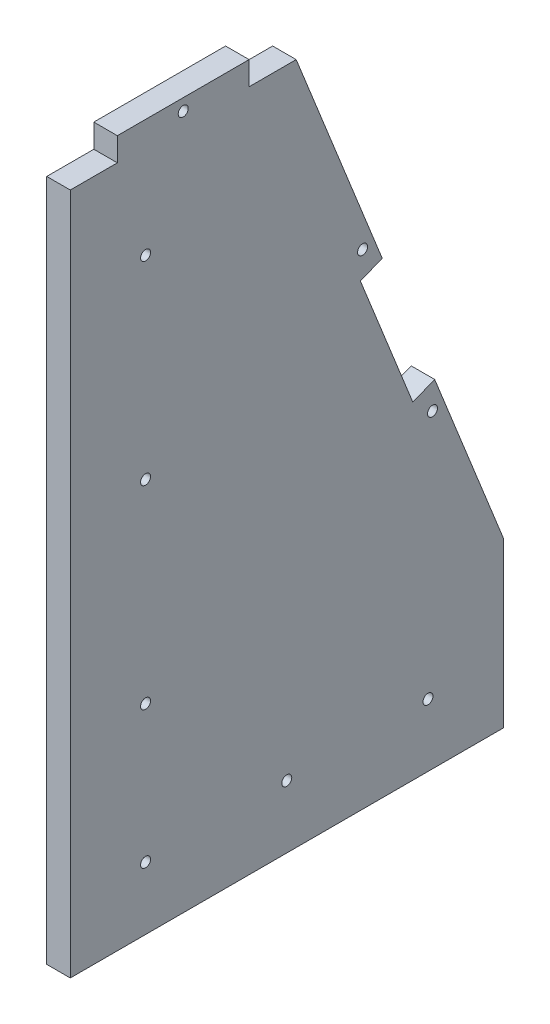
ISO-10303-21;
HEADER;
FILE_DESCRIPTION(('STEP AP214'),'2;1');
FILE_NAME('part.step','',(''),(''),'','','');
FILE_SCHEMA(('AUTOMOTIVE_DESIGN { 1 0 10303 214 1 1 1 1 }'));
ENDSEC;
DATA;
#1=APPLICATION_CONTEXT('core data for automotive mechanical design processes');
#2=APPLICATION_PROTOCOL_DEFINITION('international standard','automotive_design',2000,#1);
#3=PRODUCT_CONTEXT('',#1,'mechanical');
#4=PRODUCT('Part','Part','',(#3));
#5=PRODUCT_RELATED_PRODUCT_CATEGORY('part','',(#4));
#6=PRODUCT_DEFINITION_FORMATION('','',#4);
#7=PRODUCT_DEFINITION_CONTEXT('part definition',#1,'design');
#8=PRODUCT_DEFINITION('design','',#6,#7);
#9=PRODUCT_DEFINITION_SHAPE('','',#8);
#10=(LENGTH_UNIT() NAMED_UNIT(*) SI_UNIT(.MILLI.,.METRE.));
#11=(NAMED_UNIT(*) PLANE_ANGLE_UNIT() SI_UNIT($,.RADIAN.));
#12=(NAMED_UNIT(*) SI_UNIT($,.STERADIAN.) SOLID_ANGLE_UNIT());
#13=UNCERTAINTY_MEASURE_WITH_UNIT(LENGTH_MEASURE(1.E-05),#10,'distance_accuracy_value','');
#14=(GEOMETRIC_REPRESENTATION_CONTEXT(3) GLOBAL_UNCERTAINTY_ASSIGNED_CONTEXT((#13)) GLOBAL_UNIT_ASSIGNED_CONTEXT((#10,
#11,#12)) REPRESENTATION_CONTEXT('',''));
#15=CARTESIAN_POINT('',(0.,0.,0.));
#16=DIRECTION('',(0.,0.,1.));
#17=DIRECTION('',(1.,0.,0.));
#18=AXIS2_PLACEMENT_3D('',#15,#16,#17);
#19=CARTESIAN_POINT('',(12.7,381.,-116.84));
#20=DIRECTION('',(0.,0.371390676354104,-0.928476690885259));
#21=DIRECTION('',(0.,0.92847669088526,0.371390676354104));
#22=AXIS2_PLACEMENT_3D('',#19,#20,#21);
#23=PLANE('',#22);
#24=DIRECTION('',(1.,0.,0.));
#25=VECTOR('',#24,1.);
#26=CARTESIAN_POINT('',(-0.000999999999999265,252.183307948486,-168.366676820606));
#27=LINE('',#26,#25);
#28=CARTESIAN_POINT('',(0.,252.183307948486,-168.366676820606));
#29=VERTEX_POINT('',#28);
#30=CARTESIAN_POINT('',(12.7,252.183307948486,-168.366676820606));
#31=VERTEX_POINT('',#30);
#32=EDGE_CURVE('E143',#29,#31,#27,.T.);
#33=ORIENTED_EDGE('',*,*,#32,.F.);
#34=DIRECTION('',(0.,-0.928476690885259,-0.371390676354104));
#35=VECTOR('',#34,1.);
#36=CARTESIAN_POINT('',(0.,381.,-116.84));
#37=LINE('',#36,#35);
#38=CARTESIAN_POINT('',(0.,368.3,-121.92));
#39=VERTEX_POINT('',#38);
#40=EDGE_CURVE('E155',#39,#29,#37,.T.);
#41=ORIENTED_EDGE('',*,*,#40,.F.);
#42=DIRECTION('',(1.,0.,0.));
#43=VECTOR('',#42,1.);
#44=CARTESIAN_POINT('',(-0.000999999999999265,368.3,-121.92));
#45=LINE('',#44,#43);
#46=CARTESIAN_POINT('',(12.7,368.3,-121.92));
#47=VERTEX_POINT('',#46);
#48=EDGE_CURVE('E68',#39,#47,#45,.T.);
#49=ORIENTED_EDGE('',*,*,#48,.T.);
#50=DIRECTION('',(0.,-0.928476690885259,-0.371390676354104));
#51=VECTOR('',#50,1.);
#52=CARTESIAN_POINT('',(12.7,381.,-116.84));
#53=LINE('',#52,#51);
#54=EDGE_CURVE('E157',#47,#31,#53,.T.);
#55=ORIENTED_EDGE('',*,*,#54,.T.);
#56=EDGE_LOOP('',(#33,#41,#49,#55));
#57=FACE_BOUND('',#56,.T.);
#58=ADVANCED_FACE('F43',(#57),#23,.T.);
#59=DIRECTION('',(1.,0.,0.));
#60=VECTOR('',#59,1.);
#61=CARTESIAN_POINT('',(-0.000999999999999265,181.433384103029,-196.666646358788));
#62=LINE('',#61,#60);
#63=CARTESIAN_POINT('',(0.,181.433384103029,-196.666646358788));
#64=VERTEX_POINT('',#63);
#65=CARTESIAN_POINT('',(12.7,181.433384103029,-196.666646358788));
#66=VERTEX_POINT('',#65);
#67=EDGE_CURVE('E159',#64,#66,#62,.T.);
#68=ORIENTED_EDGE('',*,*,#67,.T.);
#69=CARTESIAN_POINT('',(12.7,88.9,-233.68));
#70=VERTEX_POINT('',#69);
#71=EDGE_CURVE('E183',#66,#70,#53,.T.);
#72=ORIENTED_EDGE('',*,*,#71,.T.);
#73=DIRECTION('',(-1.,0.,0.));
#74=VECTOR('',#73,1.);
#75=CARTESIAN_POINT('',(12.7,88.9,-233.68));
#76=LINE('',#75,#74);
#77=CARTESIAN_POINT('',(0.,88.9,-233.68));
#78=VERTEX_POINT('',#77);
#79=EDGE_CURVE('E47',#70,#78,#76,.T.);
#80=ORIENTED_EDGE('',*,*,#79,.T.);
#81=EDGE_CURVE('E166',#64,#78,#37,.T.);
#82=ORIENTED_EDGE('',*,*,#81,.F.);
#83=EDGE_LOOP('',(#68,#72,#80,#82));
#84=FACE_BOUND('',#83,.T.);
#85=ADVANCED_FACE('F45',(#84),#23,.T.);
#86=CARTESIAN_POINT('',(12.7,381.,0.));
#87=DIRECTION('',(0.,1.,0.));
#88=DIRECTION('',(0.,0.,1.));
#89=AXIS2_PLACEMENT_3D('',#86,#87,#88);
#90=PLANE('',#89);
#91=DIRECTION('',(1.,0.,0.));
#92=VECTOR('',#91,1.);
#93=CARTESIAN_POINT('',(-0.000999999999999265,381.,-96.52));
#94=LINE('',#93,#92);
#95=CARTESIAN_POINT('',(0.,381.,-96.52));
#96=VERTEX_POINT('',#95);
#97=CARTESIAN_POINT('',(12.7,381.,-96.52));
#98=VERTEX_POINT('',#97);
#99=EDGE_CURVE('E262',#96,#98,#94,.T.);
#100=ORIENTED_EDGE('',*,*,#99,.F.);
#101=DIRECTION('',(0.,0.,-1.));
#102=VECTOR('',#101,1.);
#103=CARTESIAN_POINT('',(0.,381.,0.));
#104=LINE('',#103,#102);
#105=CARTESIAN_POINT('',(0.,381.,-25.4));
#106=VERTEX_POINT('',#105);
#107=EDGE_CURVE('E181',#106,#96,#104,.T.);
#108=ORIENTED_EDGE('',*,*,#107,.F.);
#109=DIRECTION('',(1.,0.,0.));
#110=VECTOR('',#109,1.);
#111=CARTESIAN_POINT('',(-0.000999999999999265,381.,-25.4));
#112=LINE('',#111,#110);
#113=CARTESIAN_POINT('',(12.7,381.,-25.4));
#114=VERTEX_POINT('',#113);
#115=EDGE_CURVE('E247',#106,#114,#112,.T.);
#116=ORIENTED_EDGE('',*,*,#115,.T.);
#117=DIRECTION('',(0.,0.,-1.));
#118=VECTOR('',#117,1.);
#119=CARTESIAN_POINT('',(12.7,381.,0.));
#120=LINE('',#119,#118);
#121=EDGE_CURVE('E173',#114,#98,#120,.T.);
#122=ORIENTED_EDGE('',*,*,#121,.T.);
#123=EDGE_LOOP('',(#100,#108,#116,#122));
#124=FACE_BOUND('',#123,.T.);
#125=ADVANCED_FACE('F348',(#124),#90,.T.);
#126=CARTESIAN_POINT('',(12.7,0.,0.));
#127=DIRECTION('',(0.,0.,1.));
#128=DIRECTION('',(0.,-1.,0.));
#129=AXIS2_PLACEMENT_3D('',#126,#127,#128);
#130=PLANE('',#129);
#131=DIRECTION('',(1.,0.,0.));
#132=VECTOR('',#131,1.);
#133=CARTESIAN_POINT('',(-0.000999999999999265,368.3,0.));
#134=LINE('',#133,#132);
#135=CARTESIAN_POINT('',(0.,368.3,0.));
#136=VERTEX_POINT('',#135);
#137=CARTESIAN_POINT('',(12.7,368.3,0.));
#138=VERTEX_POINT('',#137);
#139=EDGE_CURVE('E248',#136,#138,#134,.T.);
#140=ORIENTED_EDGE('',*,*,#139,.F.);
#141=DIRECTION('',(0.,1.,0.));
#142=VECTOR('',#141,1.);
#143=CARTESIAN_POINT('',(0.,0.,0.));
#144=LINE('',#143,#142);
#145=CARTESIAN_POINT('',(0.,0.,0.));
#146=VERTEX_POINT('',#145);
#147=EDGE_CURVE('E178',#146,#136,#144,.T.);
#148=ORIENTED_EDGE('',*,*,#147,.F.);
#149=DIRECTION('',(-1.,0.,0.));
#150=VECTOR('',#149,1.);
#151=CARTESIAN_POINT('',(12.7,0.,0.));
#152=LINE('',#151,#150);
#153=CARTESIAN_POINT('',(12.7,0.,0.));
#154=VERTEX_POINT('',#153);
#155=EDGE_CURVE('E13',#154,#146,#152,.T.);
#156=ORIENTED_EDGE('',*,*,#155,.F.);
#157=DIRECTION('',(0.,1.,0.));
#158=VECTOR('',#157,1.);
#159=CARTESIAN_POINT('',(12.7,0.,0.));
#160=LINE('',#159,#158);
#161=EDGE_CURVE('E193',#154,#138,#160,.T.);
#162=ORIENTED_EDGE('',*,*,#161,.T.);
#163=EDGE_LOOP('',(#140,#148,#156,#162));
#164=FACE_BOUND('',#163,.T.);
#165=ADVANCED_FACE('F338',(#164),#130,.T.);
#166=CARTESIAN_POINT('',(12.7,0.,-233.68));
#167=DIRECTION('',(0.,-1.,0.));
#168=DIRECTION('',(0.,0.,-1.));
#169=AXIS2_PLACEMENT_3D('',#166,#167,#168);
#170=PLANE('',#169);
#171=DIRECTION('',(0.,0.,1.));
#172=VECTOR('',#171,1.);
#173=CARTESIAN_POINT('',(0.,0.,-233.68));
#174=LINE('',#173,#172);
#175=CARTESIAN_POINT('',(0.,0.,-233.68));
#176=VERTEX_POINT('',#175);
#177=EDGE_CURVE('E169',#176,#146,#174,.T.);
#178=ORIENTED_EDGE('',*,*,#177,.F.);
#179=DIRECTION('',(-1.,0.,0.));
#180=VECTOR('',#179,1.);
#181=CARTESIAN_POINT('',(12.7,0.,-233.68));
#182=LINE('',#181,#180);
#183=CARTESIAN_POINT('',(12.7,0.,-233.68));
#184=VERTEX_POINT('',#183);
#185=EDGE_CURVE('E52',#184,#176,#182,.T.);
#186=ORIENTED_EDGE('',*,*,#185,.F.);
#187=DIRECTION('',(0.,0.,1.));
#188=VECTOR('',#187,1.);
#189=CARTESIAN_POINT('',(12.7,0.,-233.68));
#190=LINE('',#189,#188);
#191=EDGE_CURVE('E199',#184,#154,#190,.T.);
#192=ORIENTED_EDGE('',*,*,#191,.T.);
#193=ORIENTED_EDGE('',*,*,#155,.T.);
#194=EDGE_LOOP('',(#178,#186,#192,#193));
#195=FACE_BOUND('',#194,.T.);
#196=ADVANCED_FACE('F337',(#195),#170,.T.);
#197=CARTESIAN_POINT('',(12.7,0.,-233.68));
#198=DIRECTION('',(0.,0.,-1.));
#199=DIRECTION('',(-1.,0.,0.));
#200=AXIS2_PLACEMENT_3D('',#197,#198,#199);
#201=PLANE('',#200);
#202=DIRECTION('',(0.,-1.,0.));
#203=VECTOR('',#202,1.);
#204=CARTESIAN_POINT('',(0.,0.,-233.68));
#205=LINE('',#204,#203);
#206=EDGE_CURVE('E165',#78,#176,#205,.T.);
#207=ORIENTED_EDGE('',*,*,#206,.F.);
#208=ORIENTED_EDGE('',*,*,#79,.F.);
#209=DIRECTION('',(0.,-1.,0.));
#210=VECTOR('',#209,1.);
#211=CARTESIAN_POINT('',(12.7,0.,-233.68));
#212=LINE('',#211,#210);
#213=EDGE_CURVE('E204',#70,#184,#212,.T.);
#214=ORIENTED_EDGE('',*,*,#213,.T.);
#215=ORIENTED_EDGE('',*,*,#185,.T.);
#216=EDGE_LOOP('',(#207,#208,#214,#215));
#217=FACE_BOUND('',#216,.T.);
#218=ADVANCED_FACE('F310',(#217),#201,.T.);
#219=CARTESIAN_POINT('',(12.7,0.,0.));
#220=DIRECTION('',(-1.,0.,0.));
#221=DIRECTION('',(0.,0.,1.));
#222=AXIS2_PLACEMENT_3D('',#219,#220,#221);
#223=PLANE('',#222);
#224=CARTESIAN_POINT('',(12.7,167.283399333938,-195.487480961364));
#225=DIRECTION('',(1.,0.,0.));
#226=DIRECTION('',(0.,0.,-1.));
#227=AXIS2_PLACEMENT_3D('',#224,#225,#226);
#228=CIRCLE('',#227,2.70000000000004);
#229=CARTESIAN_POINT('',(12.7,167.283399333938,-198.187480961364));
#230=VERTEX_POINT('',#229);
#231=EDGE_CURVE('E296',#230,#230,#228,.T.);
#232=ORIENTED_EDGE('',*,*,#231,.F.);
#233=EDGE_LOOP('',(#232));
#234=FACE_BOUND('',#233,.T.);
#235=CARTESIAN_POINT('',(12.7,261.61663112788,-157.754188243787));
#236=DIRECTION('',(1.,0.,0.));
#237=DIRECTION('',(0.,0.,-1.));
#238=AXIS2_PLACEMENT_3D('',#235,#236,#237);
#239=CIRCLE('',#238,2.70000000000001);
#240=CARTESIAN_POINT('',(12.7,261.61663112788,-160.454188243787));
#241=VERTEX_POINT('',#240);
#242=EDGE_CURVE('E292',#241,#241,#239,.T.);
#243=ORIENTED_EDGE('',*,*,#242,.F.);
#244=EDGE_LOOP('',(#243));
#245=FACE_BOUND('',#244,.T.);
#246=CARTESIAN_POINT('',(12.7,374.65,-60.96));
#247=DIRECTION('',(1.,0.,0.));
#248=DIRECTION('',(0.,0.,-1.));
#249=AXIS2_PLACEMENT_3D('',#246,#247,#248);
#250=CIRCLE('',#249,2.69999999999999);
#251=CARTESIAN_POINT('',(12.7,374.65,-63.66));
#252=VERTEX_POINT('',#251);
#253=EDGE_CURVE('E274',#252,#252,#250,.T.);
#254=ORIENTED_EDGE('',*,*,#253,.F.);
#255=EDGE_LOOP('',(#254));
#256=FACE_BOUND('',#255,.T.);
#257=CARTESIAN_POINT('',(12.7,33.8666666666667,-40.64));
#258=DIRECTION('',(-1.,0.,0.));
#259=DIRECTION('',(0.,0.,-1.));
#260=AXIS2_PLACEMENT_3D('',#257,#258,#259);
#261=CIRCLE('',#260,2.7);
#262=CARTESIAN_POINT('',(12.7,33.8666666666667,-43.34));
#263=VERTEX_POINT('',#262);
#264=EDGE_CURVE('E236',#263,#263,#261,.T.);
#265=ORIENTED_EDGE('',*,*,#264,.T.);
#266=EDGE_LOOP('',(#265));
#267=FACE_BOUND('',#266,.T.);
#268=CARTESIAN_POINT('',(12.7,33.8666666666666,-116.84));
#269=DIRECTION('',(-1.,0.,0.));
#270=DIRECTION('',(0.,0.,-1.));
#271=AXIS2_PLACEMENT_3D('',#268,#269,#270);
#272=CIRCLE('',#271,2.7);
#273=CARTESIAN_POINT('',(12.7,33.8666666666666,-119.54));
#274=VERTEX_POINT('',#273);
#275=EDGE_CURVE('E230',#274,#274,#272,.T.);
#276=ORIENTED_EDGE('',*,*,#275,.T.);
#277=EDGE_LOOP('',(#276));
#278=FACE_BOUND('',#277,.T.);
#279=CARTESIAN_POINT('',(12.7,33.8666666666666,-193.04));
#280=DIRECTION('',(-1.,0.,0.));
#281=DIRECTION('',(0.,0.,-1.));
#282=AXIS2_PLACEMENT_3D('',#279,#280,#281);
#283=CIRCLE('',#282,2.7);
#284=CARTESIAN_POINT('',(12.7,33.8666666666666,-195.74));
#285=VERTEX_POINT('',#284);
#286=EDGE_CURVE('E224',#285,#285,#283,.T.);
#287=ORIENTED_EDGE('',*,*,#286,.T.);
#288=EDGE_LOOP('',(#287));
#289=FACE_BOUND('',#288,.T.);
#290=CARTESIAN_POINT('',(12.7,107.95,-40.64));
#291=DIRECTION('',(-1.,0.,0.));
#292=DIRECTION('',(0.,0.,1.));
#293=AXIS2_PLACEMENT_3D('',#290,#291,#292);
#294=CIRCLE('',#293,2.7);
#295=CARTESIAN_POINT('',(12.7,107.95,-37.94));
#296=VERTEX_POINT('',#295);
#297=EDGE_CURVE('E218',#296,#296,#294,.T.);
#298=ORIENTED_EDGE('',*,*,#297,.T.);
#299=EDGE_LOOP('',(#298));
#300=FACE_BOUND('',#299,.T.);
#301=CARTESIAN_POINT('',(12.7,317.5,-40.64));
#302=DIRECTION('',(-1.,0.,0.));
#303=DIRECTION('',(0.,0.,1.));
#304=AXIS2_PLACEMENT_3D('',#301,#302,#303);
#305=CIRCLE('',#304,2.69999999999996);
#306=CARTESIAN_POINT('',(12.7,317.5,-37.9400000000001));
#307=VERTEX_POINT('',#306);
#308=EDGE_CURVE('E212',#307,#307,#305,.T.);
#309=ORIENTED_EDGE('',*,*,#308,.T.);
#310=EDGE_LOOP('',(#309));
#311=FACE_BOUND('',#310,.T.);
#312=CARTESIAN_POINT('',(12.7,212.725,-40.64));
#313=DIRECTION('',(-1.,0.,0.));
#314=DIRECTION('',(0.,0.,1.));
#315=AXIS2_PLACEMENT_3D('',#312,#313,#314);
#316=CIRCLE('',#315,2.70000000000001);
#317=CARTESIAN_POINT('',(12.7,212.725,-37.94));
#318=VERTEX_POINT('',#317);
#319=EDGE_CURVE('E171',#318,#318,#316,.T.);
#320=ORIENTED_EDGE('',*,*,#319,.T.);
#321=EDGE_LOOP('',(#320));
#322=FACE_BOUND('',#321,.T.);
#323=DIRECTION('',(0.,-0.928476690885259,-0.371390676354104));
#324=VECTOR('',#323,1.);
#325=CARTESIAN_POINT('',(12.7,247.466646358788,-156.575022846363));
#326=LINE('',#325,#324);
#327=CARTESIAN_POINT('',(12.7,247.466646358788,-156.575022846363));
#328=VERTEX_POINT('',#327);
#329=CARTESIAN_POINT('',(12.7,176.716722513332,-184.874992384545));
#330=VERTEX_POINT('',#329);
#331=EDGE_CURVE('E287',#328,#330,#326,.T.);
#332=ORIENTED_EDGE('',*,*,#331,.F.);
#333=DIRECTION('',(0.,-0.371390676354104,0.928476690885259));
#334=VECTOR('',#333,1.);
#335=CARTESIAN_POINT('',(12.7,247.466646358788,-156.575022846363));
#336=LINE('',#335,#334);
#337=EDGE_CURVE('E149',#31,#328,#336,.T.);
#338=ORIENTED_EDGE('',*,*,#337,.F.);
#339=ORIENTED_EDGE('',*,*,#54,.F.);
#340=DIRECTION('',(0.,0.,-1.));
#341=VECTOR('',#340,1.);
#342=CARTESIAN_POINT('',(12.7,368.3,-96.52));
#343=LINE('',#342,#341);
#344=CARTESIAN_POINT('',(12.7,368.3,-96.52));
#345=VERTEX_POINT('',#344);
#346=EDGE_CURVE('E265',#345,#47,#343,.T.);
#347=ORIENTED_EDGE('',*,*,#346,.F.);
#348=DIRECTION('',(0.,-1.,0.));
#349=VECTOR('',#348,1.);
#350=CARTESIAN_POINT('',(12.7,381.,-96.52));
#351=LINE('',#350,#349);
#352=EDGE_CURVE('E268',#98,#345,#351,.T.);
#353=ORIENTED_EDGE('',*,*,#352,.F.);
#354=ORIENTED_EDGE('',*,*,#121,.F.);
#355=DIRECTION('',(0.,1.,0.));
#356=VECTOR('',#355,1.);
#357=CARTESIAN_POINT('',(12.7,381.,-25.4));
#358=LINE('',#357,#356);
#359=CARTESIAN_POINT('',(12.7,368.3,-25.4));
#360=VERTEX_POINT('',#359);
#361=EDGE_CURVE('E251',#360,#114,#358,.T.);
#362=ORIENTED_EDGE('',*,*,#361,.F.);
#363=DIRECTION('',(0.,0.,-1.));
#364=VECTOR('',#363,1.);
#365=CARTESIAN_POINT('',(12.7,368.3,0.));
#366=LINE('',#365,#364);
#367=EDGE_CURVE('E255',#138,#360,#366,.T.);
#368=ORIENTED_EDGE('',*,*,#367,.F.);
#369=ORIENTED_EDGE('',*,*,#161,.F.);
#370=ORIENTED_EDGE('',*,*,#191,.F.);
#371=ORIENTED_EDGE('',*,*,#213,.F.);
#372=ORIENTED_EDGE('',*,*,#71,.F.);
#373=DIRECTION('',(0.,0.371390676354105,-0.928476690885259));
#374=VECTOR('',#373,1.);
#375=CARTESIAN_POINT('',(12.7,176.716722513332,-184.874992384545));
#376=LINE('',#375,#374);
#377=EDGE_CURVE('E282',#330,#66,#376,.T.);
#378=ORIENTED_EDGE('',*,*,#377,.F.);
#379=EDGE_LOOP('',(#332,#338,#339,#347,#353,#354,#362,#368,#369,#370,#371,#372,#378));
#380=FACE_BOUND('',#379,.T.);
#381=ADVANCED_FACE('F307',(#234,#245,#256,#267,#278,#289,#300,#311,#322,#380),#223,.F.);
#382=CARTESIAN_POINT('',(0.,0.,0.));
#383=DIRECTION('',(-1.,0.,0.));
#384=DIRECTION('',(0.,0.,1.));
#385=AXIS2_PLACEMENT_3D('',#382,#383,#384);
#386=PLANE('',#385);
#387=CARTESIAN_POINT('',(0.,167.283399333938,-195.487480961364));
#388=DIRECTION('',(-1.,0.,0.));
#389=DIRECTION('',(0.,0.,1.));
#390=AXIS2_PLACEMENT_3D('',#387,#388,#389);
#391=CIRCLE('',#390,2.70000000000004);
#392=CARTESIAN_POINT('',(0.,167.283399333938,-192.787480961364));
#393=VERTEX_POINT('',#392);
#394=EDGE_CURVE('E299',#393,#393,#391,.F.);
#395=ORIENTED_EDGE('',*,*,#394,.T.);
#396=EDGE_LOOP('',(#395));
#397=FACE_BOUND('',#396,.T.);
#398=CARTESIAN_POINT('',(0.,261.61663112788,-157.754188243787));
#399=DIRECTION('',(-1.,0.,0.));
#400=DIRECTION('',(0.,0.,1.));
#401=AXIS2_PLACEMENT_3D('',#398,#399,#400);
#402=CIRCLE('',#401,2.70000000000001);
#403=CARTESIAN_POINT('',(0.,261.61663112788,-155.054188243787));
#404=VERTEX_POINT('',#403);
#405=EDGE_CURVE('E293',#404,#404,#402,.F.);
#406=ORIENTED_EDGE('',*,*,#405,.T.);
#407=EDGE_LOOP('',(#406));
#408=FACE_BOUND('',#407,.T.);
#409=DIRECTION('',(0.,-0.371390676354104,0.928476690885259));
#410=VECTOR('',#409,1.);
#411=CARTESIAN_POINT('',(0.,247.466646358788,-156.575022846363));
#412=LINE('',#411,#410);
#413=CARTESIAN_POINT('',(0.,247.466646358788,-156.575022846363));
#414=VERTEX_POINT('',#413);
#415=EDGE_CURVE('E139',#29,#414,#412,.T.);
#416=ORIENTED_EDGE('',*,*,#415,.T.);
#417=DIRECTION('',(0.,-0.928476690885259,-0.371390676354104));
#418=VECTOR('',#417,1.);
#419=CARTESIAN_POINT('',(0.,247.466646358788,-156.575022846363));
#420=LINE('',#419,#418);
#421=CARTESIAN_POINT('',(0.,176.716722513332,-184.874992384546));
#422=VERTEX_POINT('',#421);
#423=EDGE_CURVE('E158',#414,#422,#420,.T.);
#424=ORIENTED_EDGE('',*,*,#423,.T.);
#425=DIRECTION('',(0.,0.371390676354105,-0.928476690885259));
#426=VECTOR('',#425,1.);
#427=CARTESIAN_POINT('',(0.,176.716722513332,-184.874992384545));
#428=LINE('',#427,#426);
#429=EDGE_CURVE('E150',#422,#64,#428,.T.);
#430=ORIENTED_EDGE('',*,*,#429,.T.);
#431=ORIENTED_EDGE('',*,*,#81,.T.);
#432=ORIENTED_EDGE('',*,*,#206,.T.);
#433=ORIENTED_EDGE('',*,*,#177,.T.);
#434=ORIENTED_EDGE('',*,*,#147,.T.);
#435=DIRECTION('',(0.,0.,-1.));
#436=VECTOR('',#435,1.);
#437=CARTESIAN_POINT('',(0.,368.3,0.));
#438=LINE('',#437,#436);
#439=CARTESIAN_POINT('',(0.,368.3,-25.4));
#440=VERTEX_POINT('',#439);
#441=EDGE_CURVE('E242',#136,#440,#438,.T.);
#442=ORIENTED_EDGE('',*,*,#441,.T.);
#443=DIRECTION('',(0.,1.,0.));
#444=VECTOR('',#443,1.);
#445=CARTESIAN_POINT('',(0.,381.,-25.4));
#446=LINE('',#445,#444);
#447=EDGE_CURVE('E258',#440,#106,#446,.T.);
#448=ORIENTED_EDGE('',*,*,#447,.T.);
#449=ORIENTED_EDGE('',*,*,#107,.T.);
#450=DIRECTION('',(0.,-1.,0.));
#451=VECTOR('',#450,1.);
#452=CARTESIAN_POINT('',(0.,381.,-96.52));
#453=LINE('',#452,#451);
#454=CARTESIAN_POINT('',(0.,368.3,-96.52));
#455=VERTEX_POINT('',#454);
#456=EDGE_CURVE('E271',#96,#455,#453,.T.);
#457=ORIENTED_EDGE('',*,*,#456,.T.);
#458=DIRECTION('',(0.,0.,-1.));
#459=VECTOR('',#458,1.);
#460=CARTESIAN_POINT('',(0.,368.3,-96.52));
#461=LINE('',#460,#459);
#462=EDGE_CURVE('E164',#455,#39,#461,.T.);
#463=ORIENTED_EDGE('',*,*,#462,.T.);
#464=ORIENTED_EDGE('',*,*,#40,.T.);
#465=EDGE_LOOP('',(#416,#424,#430,#431,#432,#433,#434,#442,#448,#449,#457,#463,#464));
#466=FACE_BOUND('',#465,.T.);
#467=CARTESIAN_POINT('',(0.,374.65,-60.96));
#468=DIRECTION('',(-1.,0.,0.));
#469=DIRECTION('',(0.,0.,1.));
#470=AXIS2_PLACEMENT_3D('',#467,#468,#469);
#471=CIRCLE('',#470,2.69999999999999);
#472=CARTESIAN_POINT('',(0.,374.65,-58.26));
#473=VERTEX_POINT('',#472);
#474=EDGE_CURVE('E275',#473,#473,#471,.F.);
#475=ORIENTED_EDGE('',*,*,#474,.T.);
#476=EDGE_LOOP('',(#475));
#477=FACE_BOUND('',#476,.T.);
#478=CARTESIAN_POINT('',(0.,33.8666666666667,-40.64));
#479=DIRECTION('',(-1.,0.,0.));
#480=DIRECTION('',(0.,0.,-1.));
#481=AXIS2_PLACEMENT_3D('',#478,#479,#480);
#482=CIRCLE('',#481,2.7);
#483=CARTESIAN_POINT('',(0.,33.8666666666667,-43.34));
#484=VERTEX_POINT('',#483);
#485=EDGE_CURVE('E239',#484,#484,#482,.T.);
#486=ORIENTED_EDGE('',*,*,#485,.F.);
#487=EDGE_LOOP('',(#486));
#488=FACE_BOUND('',#487,.T.);
#489=CARTESIAN_POINT('',(0.,33.8666666666666,-116.84));
#490=DIRECTION('',(-1.,0.,0.));
#491=DIRECTION('',(0.,0.,-1.));
#492=AXIS2_PLACEMENT_3D('',#489,#490,#491);
#493=CIRCLE('',#492,2.7);
#494=CARTESIAN_POINT('',(0.,33.8666666666666,-119.54));
#495=VERTEX_POINT('',#494);
#496=EDGE_CURVE('E233',#495,#495,#493,.T.);
#497=ORIENTED_EDGE('',*,*,#496,.F.);
#498=EDGE_LOOP('',(#497));
#499=FACE_BOUND('',#498,.T.);
#500=CARTESIAN_POINT('',(0.,33.8666666666666,-193.04));
#501=DIRECTION('',(-1.,0.,0.));
#502=DIRECTION('',(0.,0.,-1.));
#503=AXIS2_PLACEMENT_3D('',#500,#501,#502);
#504=CIRCLE('',#503,2.7);
#505=CARTESIAN_POINT('',(0.,33.8666666666666,-195.74));
#506=VERTEX_POINT('',#505);
#507=EDGE_CURVE('E227',#506,#506,#504,.T.);
#508=ORIENTED_EDGE('',*,*,#507,.F.);
#509=EDGE_LOOP('',(#508));
#510=FACE_BOUND('',#509,.T.);
#511=CARTESIAN_POINT('',(0.,107.95,-40.64));
#512=DIRECTION('',(-1.,0.,0.));
#513=DIRECTION('',(0.,0.,1.));
#514=AXIS2_PLACEMENT_3D('',#511,#512,#513);
#515=CIRCLE('',#514,2.7);
#516=CARTESIAN_POINT('',(0.,107.95,-37.94));
#517=VERTEX_POINT('',#516);
#518=EDGE_CURVE('E221',#517,#517,#515,.T.);
#519=ORIENTED_EDGE('',*,*,#518,.F.);
#520=EDGE_LOOP('',(#519));
#521=FACE_BOUND('',#520,.T.);
#522=CARTESIAN_POINT('',(0.,317.5,-40.64));
#523=DIRECTION('',(-1.,0.,0.));
#524=DIRECTION('',(0.,0.,1.));
#525=AXIS2_PLACEMENT_3D('',#522,#523,#524);
#526=CIRCLE('',#525,2.69999999999996);
#527=CARTESIAN_POINT('',(0.,317.5,-37.9400000000001));
#528=VERTEX_POINT('',#527);
#529=EDGE_CURVE('E215',#528,#528,#526,.T.);
#530=ORIENTED_EDGE('',*,*,#529,.F.);
#531=EDGE_LOOP('',(#530));
#532=FACE_BOUND('',#531,.T.);
#533=CARTESIAN_POINT('',(0.,212.725,-40.64));
#534=DIRECTION('',(-1.,0.,0.));
#535=DIRECTION('',(0.,0.,1.));
#536=AXIS2_PLACEMENT_3D('',#533,#534,#535);
#537=CIRCLE('',#536,2.70000000000001);
#538=CARTESIAN_POINT('',(0.,212.725,-37.94));
#539=VERTEX_POINT('',#538);
#540=EDGE_CURVE('E209',#539,#539,#537,.T.);
#541=ORIENTED_EDGE('',*,*,#540,.F.);
#542=EDGE_LOOP('',(#541));
#543=FACE_BOUND('',#542,.T.);
#544=ADVANCED_FACE('F161',(#397,#408,#466,#477,#488,#499,#510,#521,#532,#543),#386,.T.);
#545=CARTESIAN_POINT('',(12.7,212.725,-40.64));
#546=DIRECTION('',(-1.,0.,0.));
#547=DIRECTION('',(0.,0.,1.));
#548=AXIS2_PLACEMENT_3D('',#545,#546,#547);
#549=CYLINDRICAL_SURFACE('',#548,2.70000000000001);
#550=ORIENTED_EDGE('',*,*,#319,.F.);
#551=EDGE_LOOP('',(#550));
#552=FACE_BOUND('',#551,.T.);
#553=ORIENTED_EDGE('',*,*,#540,.T.);
#554=EDGE_LOOP('',(#553));
#555=FACE_BOUND('',#554,.T.);
#556=ADVANCED_FACE('F395',(#552,#555),#549,.F.);
#557=CARTESIAN_POINT('',(12.7,317.5,-40.64));
#558=DIRECTION('',(-1.,0.,0.));
#559=DIRECTION('',(0.,0.,1.));
#560=AXIS2_PLACEMENT_3D('',#557,#558,#559);
#561=CYLINDRICAL_SURFACE('',#560,2.69999999999996);
#562=ORIENTED_EDGE('',*,*,#308,.F.);
#563=EDGE_LOOP('',(#562));
#564=FACE_BOUND('',#563,.T.);
#565=ORIENTED_EDGE('',*,*,#529,.T.);
#566=EDGE_LOOP('',(#565));
#567=FACE_BOUND('',#566,.T.);
#568=ADVANCED_FACE('F402',(#564,#567),#561,.F.);
#569=CARTESIAN_POINT('',(12.7,107.95,-40.64));
#570=DIRECTION('',(-1.,0.,0.));
#571=DIRECTION('',(0.,0.,1.));
#572=AXIS2_PLACEMENT_3D('',#569,#570,#571);
#573=CYLINDRICAL_SURFACE('',#572,2.7);
#574=ORIENTED_EDGE('',*,*,#297,.F.);
#575=EDGE_LOOP('',(#574));
#576=FACE_BOUND('',#575,.T.);
#577=ORIENTED_EDGE('',*,*,#518,.T.);
#578=EDGE_LOOP('',(#577));
#579=FACE_BOUND('',#578,.T.);
#580=ADVANCED_FACE('F410',(#576,#579),#573,.F.);
#581=CARTESIAN_POINT('',(12.7,33.8666666666666,-193.04));
#582=DIRECTION('',(-1.,0.,0.));
#583=DIRECTION('',(0.,0.,1.));
#584=AXIS2_PLACEMENT_3D('',#581,#582,#583);
#585=CYLINDRICAL_SURFACE('',#584,2.7);
#586=ORIENTED_EDGE('',*,*,#286,.F.);
#587=EDGE_LOOP('',(#586));
#588=FACE_BOUND('',#587,.T.);
#589=ORIENTED_EDGE('',*,*,#507,.T.);
#590=EDGE_LOOP('',(#589));
#591=FACE_BOUND('',#590,.T.);
#592=ADVANCED_FACE('F418',(#588,#591),#585,.F.);
#593=CARTESIAN_POINT('',(12.7,33.8666666666666,-116.84));
#594=DIRECTION('',(-1.,0.,0.));
#595=DIRECTION('',(0.,0.,1.));
#596=AXIS2_PLACEMENT_3D('',#593,#594,#595);
#597=CYLINDRICAL_SURFACE('',#596,2.7);
#598=ORIENTED_EDGE('',*,*,#275,.F.);
#599=EDGE_LOOP('',(#598));
#600=FACE_BOUND('',#599,.T.);
#601=ORIENTED_EDGE('',*,*,#496,.T.);
#602=EDGE_LOOP('',(#601));
#603=FACE_BOUND('',#602,.T.);
#604=ADVANCED_FACE('F426',(#600,#603),#597,.F.);
#605=CARTESIAN_POINT('',(12.7,33.8666666666667,-40.64));
#606=DIRECTION('',(-1.,0.,0.));
#607=DIRECTION('',(0.,0.,1.));
#608=AXIS2_PLACEMENT_3D('',#605,#606,#607);
#609=CYLINDRICAL_SURFACE('',#608,2.7);
#610=ORIENTED_EDGE('',*,*,#264,.F.);
#611=EDGE_LOOP('',(#610));
#612=FACE_BOUND('',#611,.T.);
#613=ORIENTED_EDGE('',*,*,#485,.T.);
#614=EDGE_LOOP('',(#613));
#615=FACE_BOUND('',#614,.T.);
#616=ADVANCED_FACE('F434',(#612,#615),#609,.F.);
#617=CARTESIAN_POINT('',(-0.000999999999999265,381.,-25.4));
#618=DIRECTION('',(0.,0.,-1.));
#619=DIRECTION('',(-1.,0.,0.));
#620=AXIS2_PLACEMENT_3D('',#617,#618,#619);
#621=PLANE('',#620);
#622=DIRECTION('',(1.,0.,0.));
#623=VECTOR('',#622,1.);
#624=CARTESIAN_POINT('',(-0.000999999999999265,368.3,-25.4));
#625=LINE('',#624,#623);
#626=EDGE_CURVE('E250',#440,#360,#625,.T.);
#627=ORIENTED_EDGE('',*,*,#626,.T.);
#628=ORIENTED_EDGE('',*,*,#361,.T.);
#629=ORIENTED_EDGE('',*,*,#115,.F.);
#630=ORIENTED_EDGE('',*,*,#447,.F.);
#631=EDGE_LOOP('',(#627,#628,#629,#630));
#632=FACE_BOUND('',#631,.T.);
#633=ADVANCED_FACE('F345',(#632),#621,.F.);
#634=CARTESIAN_POINT('',(-0.000999999999999265,368.3,0.));
#635=DIRECTION('',(0.,-1.,0.));
#636=DIRECTION('',(0.,0.,-1.));
#637=AXIS2_PLACEMENT_3D('',#634,#635,#636);
#638=PLANE('',#637);
#639=ORIENTED_EDGE('',*,*,#139,.T.);
#640=ORIENTED_EDGE('',*,*,#367,.T.);
#641=ORIENTED_EDGE('',*,*,#626,.F.);
#642=ORIENTED_EDGE('',*,*,#441,.F.);
#643=EDGE_LOOP('',(#639,#640,#641,#642));
#644=FACE_BOUND('',#643,.T.);
#645=ADVANCED_FACE('F341',(#644),#638,.F.);
#646=CARTESIAN_POINT('',(-0.000999999999999265,381.,-96.52));
#647=DIRECTION('',(0.,0.,1.));
#648=DIRECTION('',(1.,0.,0.));
#649=AXIS2_PLACEMENT_3D('',#646,#647,#648);
#650=PLANE('',#649);
#651=ORIENTED_EDGE('',*,*,#99,.T.);
#652=ORIENTED_EDGE('',*,*,#352,.T.);
#653=DIRECTION('',(1.,0.,0.));
#654=VECTOR('',#653,1.);
#655=CARTESIAN_POINT('',(-0.000999999999999265,368.3,-96.52));
#656=LINE('',#655,#654);
#657=EDGE_CURVE('E263',#455,#345,#656,.T.);
#658=ORIENTED_EDGE('',*,*,#657,.F.);
#659=ORIENTED_EDGE('',*,*,#456,.F.);
#660=EDGE_LOOP('',(#651,#652,#658,#659));
#661=FACE_BOUND('',#660,.T.);
#662=ADVANCED_FACE('F351',(#661),#650,.F.);
#663=CARTESIAN_POINT('',(-0.000999999999999265,368.3,-96.52));
#664=DIRECTION('',(0.,-1.,0.));
#665=DIRECTION('',(0.,0.,-1.));
#666=AXIS2_PLACEMENT_3D('',#663,#664,#665);
#667=PLANE('',#666);
#668=ORIENTED_EDGE('',*,*,#657,.T.);
#669=ORIENTED_EDGE('',*,*,#346,.T.);
#670=ORIENTED_EDGE('',*,*,#48,.F.);
#671=ORIENTED_EDGE('',*,*,#462,.F.);
#672=EDGE_LOOP('',(#668,#669,#670,#671));
#673=FACE_BOUND('',#672,.T.);
#674=ADVANCED_FACE('F353',(#673),#667,.F.);
#675=CARTESIAN_POINT('',(-0.000999999999999265,374.65,-60.96));
#676=DIRECTION('',(1.,0.,0.));
#677=DIRECTION('',(0.,0.,-1.));
#678=AXIS2_PLACEMENT_3D('',#675,#676,#677);
#679=CYLINDRICAL_SURFACE('',#678,2.69999999999999);
#680=ORIENTED_EDGE('',*,*,#474,.F.);
#681=EDGE_LOOP('',(#680));
#682=FACE_BOUND('',#681,.T.);
#683=ORIENTED_EDGE('',*,*,#253,.T.);
#684=EDGE_LOOP('',(#683));
#685=FACE_BOUND('',#684,.T.);
#686=ADVANCED_FACE('F355',(#682,#685),#679,.F.);
#687=CARTESIAN_POINT('',(-0.000999999999999265,247.466646358788,-156.575022846363));
#688=DIRECTION('',(0.,0.928476690885259,0.371390676354104));
#689=DIRECTION('',(0.,-0.371390676354104,0.928476690885259));
#690=AXIS2_PLACEMENT_3D('',#687,#688,#689);
#691=PLANE('',#690);
#692=ORIENTED_EDGE('',*,*,#32,.T.);
#693=ORIENTED_EDGE('',*,*,#337,.T.);
#694=DIRECTION('',(1.,0.,0.));
#695=VECTOR('',#694,1.);
#696=CARTESIAN_POINT('',(-0.000999999999999265,247.466646358788,-156.575022846363));
#697=LINE('',#696,#695);
#698=EDGE_CURVE('E145',#414,#328,#697,.T.);
#699=ORIENTED_EDGE('',*,*,#698,.F.);
#700=ORIENTED_EDGE('',*,*,#415,.F.);
#701=EDGE_LOOP('',(#692,#693,#699,#700));
#702=FACE_BOUND('',#701,.T.);
#703=ADVANCED_FACE('F141',(#702),#691,.F.);
#704=CARTESIAN_POINT('',(-0.000999999999999265,176.716722513332,-184.874992384545));
#705=DIRECTION('',(0.,-0.928476690885259,-0.371390676354105));
#706=DIRECTION('',(0.,0.371390676354105,-0.928476690885259));
#707=AXIS2_PLACEMENT_3D('',#704,#705,#706);
#708=PLANE('',#707);
#709=DIRECTION('',(1.,0.,0.));
#710=VECTOR('',#709,1.);
#711=CARTESIAN_POINT('',(-0.000999999999999265,176.716722513332,-184.874992384545));
#712=LINE('',#711,#710);
#713=EDGE_CURVE('E60',#422,#330,#712,.T.);
#714=ORIENTED_EDGE('',*,*,#713,.T.);
#715=ORIENTED_EDGE('',*,*,#377,.T.);
#716=ORIENTED_EDGE('',*,*,#67,.F.);
#717=ORIENTED_EDGE('',*,*,#429,.F.);
#718=EDGE_LOOP('',(#714,#715,#716,#717));
#719=FACE_BOUND('',#718,.T.);
#720=ADVANCED_FACE('F522',(#719),#708,.F.);
#721=CARTESIAN_POINT('',(-0.000999999999999265,247.466646358788,-156.575022846363));
#722=DIRECTION('',(0.,-0.371390676354104,0.92847669088526));
#723=DIRECTION('',(0.,-0.928476690885259,-0.371390676354104));
#724=AXIS2_PLACEMENT_3D('',#721,#722,#723);
#725=PLANE('',#724);
#726=ORIENTED_EDGE('',*,*,#698,.T.);
#727=ORIENTED_EDGE('',*,*,#331,.T.);
#728=ORIENTED_EDGE('',*,*,#713,.F.);
#729=ORIENTED_EDGE('',*,*,#423,.F.);
#730=EDGE_LOOP('',(#726,#727,#728,#729));
#731=FACE_BOUND('',#730,.T.);
#732=ADVANCED_FACE('F331',(#731),#725,.F.);
#733=CARTESIAN_POINT('',(-0.000999999999999265,261.61663112788,-157.754188243787));
#734=DIRECTION('',(1.,0.,0.));
#735=DIRECTION('',(0.,0.,-1.));
#736=AXIS2_PLACEMENT_3D('',#733,#734,#735);
#737=CYLINDRICAL_SURFACE('',#736,2.70000000000001);
#738=ORIENTED_EDGE('',*,*,#405,.F.);
#739=EDGE_LOOP('',(#738));
#740=FACE_BOUND('',#739,.T.);
#741=ORIENTED_EDGE('',*,*,#242,.T.);
#742=EDGE_LOOP('',(#741));
#743=FACE_BOUND('',#742,.T.);
#744=ADVANCED_FACE('F537',(#740,#743),#737,.F.);
#745=CARTESIAN_POINT('',(-0.000999999999999265,167.283399333938,-195.487480961364));
#746=DIRECTION('',(1.,0.,0.));
#747=DIRECTION('',(0.,0.,-1.));
#748=AXIS2_PLACEMENT_3D('',#745,#746,#747);
#749=CYLINDRICAL_SURFACE('',#748,2.70000000000004);
#750=ORIENTED_EDGE('',*,*,#394,.F.);
#751=EDGE_LOOP('',(#750));
#752=FACE_BOUND('',#751,.T.);
#753=ORIENTED_EDGE('',*,*,#231,.T.);
#754=EDGE_LOOP('',(#753));
#755=FACE_BOUND('',#754,.T.);
#756=ADVANCED_FACE('F305',(#752,#755),#749,.F.);
#757=CLOSED_SHELL('',(#58,#85,#125,#165,#196,#218,#381,#544,#556,#568,#580,#592,#604,#616,#633,
#645,#662,#674,#686,#703,#720,#732,#744,#756));
#758=MANIFOLD_SOLID_BREP('B2',#757);
#759=ADVANCED_BREP_SHAPE_REPRESENTATION('',(#18,#758),#14);
#760=SHAPE_DEFINITION_REPRESENTATION(#9,#759);
ENDSEC;
END-ISO-10303-21;
